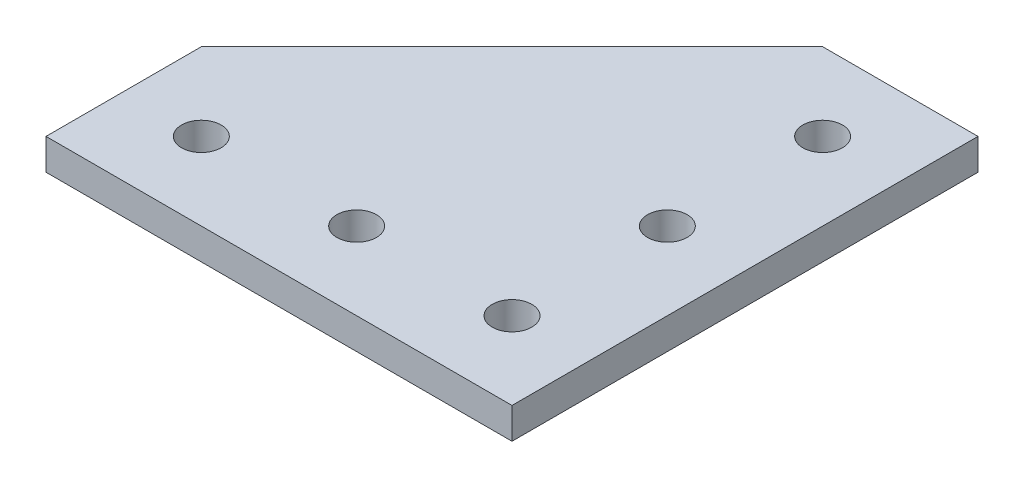
ISO-10303-21;
HEADER;
FILE_DESCRIPTION(('STEP AP214'),'2;1');
FILE_NAME('part.step','',(''),(''),'','','');
FILE_SCHEMA(('AUTOMOTIVE_DESIGN { 1 0 10303 214 1 1 1 1 }'));
ENDSEC;
DATA;
#1=APPLICATION_CONTEXT('core data for automotive mechanical design processes');
#2=APPLICATION_PROTOCOL_DEFINITION('international standard','automotive_design',2000,#1);
#3=PRODUCT_CONTEXT('',#1,'mechanical');
#4=PRODUCT('Part','Part','',(#3));
#5=PRODUCT_RELATED_PRODUCT_CATEGORY('part','',(#4));
#6=PRODUCT_DEFINITION_FORMATION('','',#4);
#7=PRODUCT_DEFINITION_CONTEXT('part definition',#1,'design');
#8=PRODUCT_DEFINITION('design','',#6,#7);
#9=PRODUCT_DEFINITION_SHAPE('','',#8);
#10=(LENGTH_UNIT() NAMED_UNIT(*) SI_UNIT(.MILLI.,.METRE.));
#11=(NAMED_UNIT(*) PLANE_ANGLE_UNIT() SI_UNIT($,.RADIAN.));
#12=(NAMED_UNIT(*) SI_UNIT($,.STERADIAN.) SOLID_ANGLE_UNIT());
#13=UNCERTAINTY_MEASURE_WITH_UNIT(LENGTH_MEASURE(1.E-05),#10,'distance_accuracy_value','');
#14=(GEOMETRIC_REPRESENTATION_CONTEXT(3) GLOBAL_UNCERTAINTY_ASSIGNED_CONTEXT((#13)) GLOBAL_UNIT_ASSIGNED_CONTEXT((#10,
#11,#12)) REPRESENTATION_CONTEXT('',''));
#15=CARTESIAN_POINT('',(0.,0.,0.));
#16=DIRECTION('',(0.,0.,1.));
#17=DIRECTION('',(1.,0.,0.));
#18=AXIS2_PLACEMENT_3D('',#15,#16,#17);
#19=CARTESIAN_POINT('',(0.,4.,0.));
#20=DIRECTION('',(0.,-1.,0.));
#21=DIRECTION('',(0.,0.,-1.));
#22=AXIS2_PLACEMENT_3D('',#19,#20,#21);
#23=PLANE('',#22);
#24=CARTESIAN_POINT('',(0.,4.,-20.));
#25=DIRECTION('',(0.,1.,0.));
#26=DIRECTION('',(0.,0.,1.));
#27=AXIS2_PLACEMENT_3D('',#24,#25,#26);
#28=CIRCLE('',#27,2.55);
#29=CARTESIAN_POINT('',(0.,4.,-17.45));
#30=VERTEX_POINT('',#29);
#31=EDGE_CURVE('E178',#30,#30,#28,.T.);
#32=ORIENTED_EDGE('',*,*,#31,.F.);
#33=EDGE_LOOP('',(#32));
#34=FACE_BOUND('',#33,.T.);
#35=CARTESIAN_POINT('',(-40.,4.,2.79318507107451E-13));
#36=DIRECTION('',(0.,1.,0.));
#37=DIRECTION('',(0.,0.,1.));
#38=AXIS2_PLACEMENT_3D('',#35,#36,#37);
#39=CIRCLE('',#38,2.55);
#40=CARTESIAN_POINT('',(-40.,4.,2.55000000000028));
#41=VERTEX_POINT('',#40);
#42=EDGE_CURVE('E190',#41,#41,#39,.T.);
#43=ORIENTED_EDGE('',*,*,#42,.F.);
#44=EDGE_LOOP('',(#43));
#45=FACE_BOUND('',#44,.T.);
#46=DIRECTION('',(-0.707106781186548,0.,0.707106781186547));
#47=VECTOR('',#46,1.);
#48=CARTESIAN_POINT('',(-50.,4.,-10.));
#49=LINE('',#48,#47);
#50=CARTESIAN_POINT('',(-10.,4.,-50.));
#51=VERTEX_POINT('',#50);
#52=CARTESIAN_POINT('',(-50.,4.,-10.));
#53=VERTEX_POINT('',#52);
#54=EDGE_CURVE('E118',#51,#53,#49,.T.);
#55=ORIENTED_EDGE('',*,*,#54,.T.);
#56=DIRECTION('',(0.,0.,1.));
#57=VECTOR('',#56,1.);
#58=CARTESIAN_POINT('',(-50.,4.,10.));
#59=LINE('',#58,#57);
#60=CARTESIAN_POINT('',(-50.,4.,10.));
#61=VERTEX_POINT('',#60);
#62=EDGE_CURVE('E85',#53,#61,#59,.T.);
#63=ORIENTED_EDGE('',*,*,#62,.T.);
#64=DIRECTION('',(1.,0.,0.));
#65=VECTOR('',#64,1.);
#66=CARTESIAN_POINT('',(10.,4.,9.99999999999999));
#67=LINE('',#66,#65);
#68=CARTESIAN_POINT('',(10.,4.,9.99999999999999));
#69=VERTEX_POINT('',#68);
#70=EDGE_CURVE('E89',#61,#69,#67,.T.);
#71=ORIENTED_EDGE('',*,*,#70,.T.);
#72=DIRECTION('',(0.,0.,-1.));
#73=VECTOR('',#72,1.);
#74=CARTESIAN_POINT('',(10.,4.,9.99999999999999));
#75=LINE('',#74,#73);
#76=CARTESIAN_POINT('',(10.,4.,-50.));
#77=VERTEX_POINT('',#76);
#78=EDGE_CURVE('E93',#69,#77,#75,.T.);
#79=ORIENTED_EDGE('',*,*,#78,.T.);
#80=DIRECTION('',(-1.,0.,0.));
#81=VECTOR('',#80,1.);
#82=CARTESIAN_POINT('',(-10.,4.,-50.));
#83=LINE('',#82,#81);
#84=EDGE_CURVE('E51',#77,#51,#83,.T.);
#85=ORIENTED_EDGE('',*,*,#84,.T.);
#86=EDGE_LOOP('',(#55,#63,#71,#79,#85));
#87=FACE_BOUND('',#86,.T.);
#88=CARTESIAN_POINT('',(-20.,4.,1.39659253553725E-13));
#89=DIRECTION('',(0.,1.,0.));
#90=DIRECTION('',(0.,0.,1.));
#91=AXIS2_PLACEMENT_3D('',#88,#89,#90);
#92=CIRCLE('',#91,2.55);
#93=CARTESIAN_POINT('',(-20.,4.,2.55000000000014));
#94=VERTEX_POINT('',#93);
#95=EDGE_CURVE('E113',#94,#94,#92,.T.);
#96=ORIENTED_EDGE('',*,*,#95,.F.);
#97=EDGE_LOOP('',(#96));
#98=FACE_BOUND('',#97,.T.);
#99=CARTESIAN_POINT('',(0.,4.,0.));
#100=DIRECTION('',(0.,1.,0.));
#101=DIRECTION('',(0.,0.,1.));
#102=AXIS2_PLACEMENT_3D('',#99,#100,#101);
#103=CIRCLE('',#102,2.55);
#104=CARTESIAN_POINT('',(0.,4.,2.55));
#105=VERTEX_POINT('',#104);
#106=EDGE_CURVE('E184',#105,#105,#103,.T.);
#107=ORIENTED_EDGE('',*,*,#106,.F.);
#108=EDGE_LOOP('',(#107));
#109=FACE_BOUND('',#108,.T.);
#110=CARTESIAN_POINT('',(-1.39693134871616E-13,4.,-40.));
#111=DIRECTION('',(0.,1.,0.));
#112=DIRECTION('',(0.,0.,1.));
#113=AXIS2_PLACEMENT_3D('',#110,#111,#112);
#114=CIRCLE('',#113,2.55);
#115=CARTESIAN_POINT('',(-1.39693134871616E-13,4.,-37.45));
#116=VERTEX_POINT('',#115);
#117=EDGE_CURVE('E169',#116,#116,#114,.T.);
#118=ORIENTED_EDGE('',*,*,#117,.F.);
#119=EDGE_LOOP('',(#118));
#120=FACE_BOUND('',#119,.T.);
#121=ADVANCED_FACE('F34',(#34,#45,#87,#98,#109,#120),#23,.F.);
#122=CARTESIAN_POINT('',(0.,0.,0.));
#123=DIRECTION('',(0.,-1.,0.));
#124=DIRECTION('',(0.,0.,-1.));
#125=AXIS2_PLACEMENT_3D('',#122,#123,#124);
#126=PLANE('',#125);
#127=CARTESIAN_POINT('',(0.,0.,-20.));
#128=DIRECTION('',(0.,1.,0.));
#129=DIRECTION('',(0.,0.,1.));
#130=AXIS2_PLACEMENT_3D('',#127,#128,#129);
#131=CIRCLE('',#130,2.55);
#132=CARTESIAN_POINT('',(0.,0.,-17.45));
#133=VERTEX_POINT('',#132);
#134=EDGE_CURVE('E175',#133,#133,#131,.T.);
#135=ORIENTED_EDGE('',*,*,#134,.T.);
#136=EDGE_LOOP('',(#135));
#137=FACE_BOUND('',#136,.T.);
#138=CARTESIAN_POINT('',(-40.,0.,2.79318507107451E-13));
#139=DIRECTION('',(0.,1.,0.));
#140=DIRECTION('',(0.,0.,1.));
#141=AXIS2_PLACEMENT_3D('',#138,#139,#140);
#142=CIRCLE('',#141,2.55);
#143=CARTESIAN_POINT('',(-40.,0.,2.55000000000028));
#144=VERTEX_POINT('',#143);
#145=EDGE_CURVE('E187',#144,#144,#142,.T.);
#146=ORIENTED_EDGE('',*,*,#145,.T.);
#147=EDGE_LOOP('',(#146));
#148=FACE_BOUND('',#147,.T.);
#149=DIRECTION('',(-0.707106781186548,0.,0.707106781186547));
#150=VECTOR('',#149,1.);
#151=CARTESIAN_POINT('',(-50.,0.,-10.));
#152=LINE('',#151,#150);
#153=CARTESIAN_POINT('',(-10.,0.,-50.));
#154=VERTEX_POINT('',#153);
#155=CARTESIAN_POINT('',(-50.,0.,-10.));
#156=VERTEX_POINT('',#155);
#157=EDGE_CURVE('E109',#154,#156,#152,.T.);
#158=ORIENTED_EDGE('',*,*,#157,.F.);
#159=DIRECTION('',(-1.,0.,0.));
#160=VECTOR('',#159,1.);
#161=CARTESIAN_POINT('',(-10.,0.,-50.));
#162=LINE('',#161,#160);
#163=CARTESIAN_POINT('',(10.,0.,-50.));
#164=VERTEX_POINT('',#163);
#165=EDGE_CURVE('E77',#164,#154,#162,.T.);
#166=ORIENTED_EDGE('',*,*,#165,.F.);
#167=DIRECTION('',(0.,0.,-1.));
#168=VECTOR('',#167,1.);
#169=CARTESIAN_POINT('',(10.,0.,9.99999999999999));
#170=LINE('',#169,#168);
#171=CARTESIAN_POINT('',(10.,0.,9.99999999999999));
#172=VERTEX_POINT('',#171);
#173=EDGE_CURVE('E71',#172,#164,#170,.T.);
#174=ORIENTED_EDGE('',*,*,#173,.F.);
#175=DIRECTION('',(1.,0.,0.));
#176=VECTOR('',#175,1.);
#177=CARTESIAN_POINT('',(10.,0.,9.99999999999999));
#178=LINE('',#177,#176);
#179=CARTESIAN_POINT('',(-50.,0.,10.));
#180=VERTEX_POINT('',#179);
#181=EDGE_CURVE('E100',#180,#172,#178,.T.);
#182=ORIENTED_EDGE('',*,*,#181,.F.);
#183=DIRECTION('',(0.,0.,1.));
#184=VECTOR('',#183,1.);
#185=CARTESIAN_POINT('',(-50.,0.,10.));
#186=LINE('',#185,#184);
#187=EDGE_CURVE('E112',#156,#180,#186,.T.);
#188=ORIENTED_EDGE('',*,*,#187,.F.);
#189=EDGE_LOOP('',(#158,#166,#174,#182,#188));
#190=FACE_BOUND('',#189,.T.);
#191=CARTESIAN_POINT('',(-20.,0.,1.39659253553725E-13));
#192=DIRECTION('',(0.,1.,0.));
#193=DIRECTION('',(0.,0.,1.));
#194=AXIS2_PLACEMENT_3D('',#191,#192,#193);
#195=CIRCLE('',#194,2.55);
#196=CARTESIAN_POINT('',(-20.,0.,2.55000000000014));
#197=VERTEX_POINT('',#196);
#198=EDGE_CURVE('E193',#197,#197,#195,.T.);
#199=ORIENTED_EDGE('',*,*,#198,.T.);
#200=EDGE_LOOP('',(#199));
#201=FACE_BOUND('',#200,.T.);
#202=CARTESIAN_POINT('',(0.,0.,0.));
#203=DIRECTION('',(0.,1.,0.));
#204=DIRECTION('',(0.,0.,1.));
#205=AXIS2_PLACEMENT_3D('',#202,#203,#204);
#206=CIRCLE('',#205,2.55);
#207=CARTESIAN_POINT('',(0.,0.,2.55));
#208=VERTEX_POINT('',#207);
#209=EDGE_CURVE('E181',#208,#208,#206,.T.);
#210=ORIENTED_EDGE('',*,*,#209,.T.);
#211=EDGE_LOOP('',(#210));
#212=FACE_BOUND('',#211,.T.);
#213=CARTESIAN_POINT('',(-1.39693134871616E-13,0.,-40.));
#214=DIRECTION('',(0.,1.,0.));
#215=DIRECTION('',(0.,0.,1.));
#216=AXIS2_PLACEMENT_3D('',#213,#214,#215);
#217=CIRCLE('',#216,2.55);
#218=CARTESIAN_POINT('',(-1.39693134871616E-13,0.,-37.45));
#219=VERTEX_POINT('',#218);
#220=EDGE_CURVE('E172',#219,#219,#217,.T.);
#221=ORIENTED_EDGE('',*,*,#220,.T.);
#222=EDGE_LOOP('',(#221));
#223=FACE_BOUND('',#222,.T.);
#224=ADVANCED_FACE('F122',(#137,#148,#190,#201,#212,#223),#126,.T.);
#225=CARTESIAN_POINT('',(-50.,4.,-10.));
#226=DIRECTION('',(0.707106781186547,0.,0.707106781186548));
#227=DIRECTION('',(0.707106781186548,0.,-0.707106781186547));
#228=AXIS2_PLACEMENT_3D('',#225,#226,#227);
#229=PLANE('',#228);
#230=ORIENTED_EDGE('',*,*,#157,.T.);
#231=DIRECTION('',(0.,-1.,0.));
#232=VECTOR('',#231,1.);
#233=CARTESIAN_POINT('',(-50.,4.,-10.));
#234=LINE('',#233,#232);
#235=EDGE_CURVE('E11',#53,#156,#234,.T.);
#236=ORIENTED_EDGE('',*,*,#235,.F.);
#237=ORIENTED_EDGE('',*,*,#54,.F.);
#238=DIRECTION('',(0.,-1.,0.));
#239=VECTOR('',#238,1.);
#240=CARTESIAN_POINT('',(-10.,4.,-50.));
#241=LINE('',#240,#239);
#242=EDGE_CURVE('E105',#51,#154,#241,.T.);
#243=ORIENTED_EDGE('',*,*,#242,.T.);
#244=EDGE_LOOP('',(#230,#236,#237,#243));
#245=FACE_BOUND('',#244,.T.);
#246=ADVANCED_FACE('F36',(#245),#229,.F.);
#247=CARTESIAN_POINT('',(-50.,4.,10.));
#248=DIRECTION('',(1.,0.,0.));
#249=DIRECTION('',(0.,0.,-1.));
#250=AXIS2_PLACEMENT_3D('',#247,#248,#249);
#251=PLANE('',#250);
#252=ORIENTED_EDGE('',*,*,#187,.T.);
#253=DIRECTION('',(0.,-1.,0.));
#254=VECTOR('',#253,1.);
#255=CARTESIAN_POINT('',(-50.,4.,10.));
#256=LINE('',#255,#254);
#257=EDGE_CURVE('E43',#61,#180,#256,.T.);
#258=ORIENTED_EDGE('',*,*,#257,.F.);
#259=ORIENTED_EDGE('',*,*,#62,.F.);
#260=ORIENTED_EDGE('',*,*,#235,.T.);
#261=EDGE_LOOP('',(#252,#258,#259,#260));
#262=FACE_BOUND('',#261,.T.);
#263=ADVANCED_FACE('F250',(#262),#251,.F.);
#264=CARTESIAN_POINT('',(10.,4.,9.99999999999999));
#265=DIRECTION('',(0.,0.,-1.));
#266=DIRECTION('',(-1.,0.,0.));
#267=AXIS2_PLACEMENT_3D('',#264,#265,#266);
#268=PLANE('',#267);
#269=ORIENTED_EDGE('',*,*,#181,.T.);
#270=DIRECTION('',(0.,-1.,0.));
#271=VECTOR('',#270,1.);
#272=CARTESIAN_POINT('',(10.,4.,9.99999999999999));
#273=LINE('',#272,#271);
#274=EDGE_CURVE('E97',#69,#172,#273,.T.);
#275=ORIENTED_EDGE('',*,*,#274,.F.);
#276=ORIENTED_EDGE('',*,*,#70,.F.);
#277=ORIENTED_EDGE('',*,*,#257,.T.);
#278=EDGE_LOOP('',(#269,#275,#276,#277));
#279=FACE_BOUND('',#278,.T.);
#280=ADVANCED_FACE('F98',(#279),#268,.F.);
#281=CARTESIAN_POINT('',(10.,4.,9.99999999999999));
#282=DIRECTION('',(-1.,0.,0.));
#283=DIRECTION('',(0.,0.,1.));
#284=AXIS2_PLACEMENT_3D('',#281,#282,#283);
#285=PLANE('',#284);
#286=ORIENTED_EDGE('',*,*,#173,.T.);
#287=DIRECTION('',(0.,-1.,0.));
#288=VECTOR('',#287,1.);
#289=CARTESIAN_POINT('',(10.,4.,-50.));
#290=LINE('',#289,#288);
#291=EDGE_CURVE('E101',#77,#164,#290,.T.);
#292=ORIENTED_EDGE('',*,*,#291,.F.);
#293=ORIENTED_EDGE('',*,*,#78,.F.);
#294=ORIENTED_EDGE('',*,*,#274,.T.);
#295=EDGE_LOOP('',(#286,#292,#293,#294));
#296=FACE_BOUND('',#295,.T.);
#297=ADVANCED_FACE('F103',(#296),#285,.F.);
#298=CARTESIAN_POINT('',(-10.,4.,-50.));
#299=DIRECTION('',(0.,0.,1.));
#300=DIRECTION('',(1.,0.,0.));
#301=AXIS2_PLACEMENT_3D('',#298,#299,#300);
#302=PLANE('',#301);
#303=ORIENTED_EDGE('',*,*,#165,.T.);
#304=ORIENTED_EDGE('',*,*,#242,.F.);
#305=ORIENTED_EDGE('',*,*,#84,.F.);
#306=ORIENTED_EDGE('',*,*,#291,.T.);
#307=EDGE_LOOP('',(#303,#304,#305,#306));
#308=FACE_BOUND('',#307,.T.);
#309=ADVANCED_FACE('F127',(#308),#302,.F.);
#310=CARTESIAN_POINT('',(-20.,4.,1.39659253553725E-13));
#311=DIRECTION('',(0.,-1.,0.));
#312=DIRECTION('',(0.,0.,-1.));
#313=AXIS2_PLACEMENT_3D('',#310,#311,#312);
#314=CYLINDRICAL_SURFACE('',#313,2.55);
#315=ORIENTED_EDGE('',*,*,#95,.T.);
#316=EDGE_LOOP('',(#315));
#317=FACE_BOUND('',#316,.T.);
#318=ORIENTED_EDGE('',*,*,#198,.F.);
#319=EDGE_LOOP('',(#318));
#320=FACE_BOUND('',#319,.T.);
#321=ADVANCED_FACE('F129',(#317,#320),#314,.F.);
#322=CARTESIAN_POINT('',(-40.,4.,2.79318507107451E-13));
#323=DIRECTION('',(0.,-1.,0.));
#324=DIRECTION('',(0.,0.,-1.));
#325=AXIS2_PLACEMENT_3D('',#322,#323,#324);
#326=CYLINDRICAL_SURFACE('',#325,2.55);
#327=ORIENTED_EDGE('',*,*,#42,.T.);
#328=EDGE_LOOP('',(#327));
#329=FACE_BOUND('',#328,.T.);
#330=ORIENTED_EDGE('',*,*,#145,.F.);
#331=EDGE_LOOP('',(#330));
#332=FACE_BOUND('',#331,.T.);
#333=ADVANCED_FACE('F135',(#329,#332),#326,.F.);
#334=CARTESIAN_POINT('',(0.,4.,0.));
#335=DIRECTION('',(0.,-1.,0.));
#336=DIRECTION('',(0.,0.,-1.));
#337=AXIS2_PLACEMENT_3D('',#334,#335,#336);
#338=CYLINDRICAL_SURFACE('',#337,2.55);
#339=ORIENTED_EDGE('',*,*,#106,.T.);
#340=EDGE_LOOP('',(#339));
#341=FACE_BOUND('',#340,.T.);
#342=ORIENTED_EDGE('',*,*,#209,.F.);
#343=EDGE_LOOP('',(#342));
#344=FACE_BOUND('',#343,.T.);
#345=ADVANCED_FACE('F152',(#341,#344),#338,.F.);
#346=CARTESIAN_POINT('',(0.,4.,-20.));
#347=DIRECTION('',(0.,-1.,0.));
#348=DIRECTION('',(0.,0.,-1.));
#349=AXIS2_PLACEMENT_3D('',#346,#347,#348);
#350=CYLINDRICAL_SURFACE('',#349,2.55);
#351=ORIENTED_EDGE('',*,*,#31,.T.);
#352=EDGE_LOOP('',(#351));
#353=FACE_BOUND('',#352,.T.);
#354=ORIENTED_EDGE('',*,*,#134,.F.);
#355=EDGE_LOOP('',(#354));
#356=FACE_BOUND('',#355,.T.);
#357=ADVANCED_FACE('F156',(#353,#356),#350,.F.);
#358=CARTESIAN_POINT('',(-1.39693134871616E-13,4.,-40.));
#359=DIRECTION('',(0.,-1.,0.));
#360=DIRECTION('',(0.,0.,-1.));
#361=AXIS2_PLACEMENT_3D('',#358,#359,#360);
#362=CYLINDRICAL_SURFACE('',#361,2.55);
#363=ORIENTED_EDGE('',*,*,#117,.T.);
#364=EDGE_LOOP('',(#363));
#365=FACE_BOUND('',#364,.T.);
#366=ORIENTED_EDGE('',*,*,#220,.F.);
#367=EDGE_LOOP('',(#366));
#368=FACE_BOUND('',#367,.T.);
#369=ADVANCED_FACE('F160',(#365,#368),#362,.F.);
#370=CLOSED_SHELL('',(#121,#224,#246,#263,#280,#297,#309,#321,#333,#345,#357,#369));
#371=MANIFOLD_SOLID_BREP('B2',#370);
#372=ADVANCED_BREP_SHAPE_REPRESENTATION('',(#18,#371),#14);
#373=SHAPE_DEFINITION_REPRESENTATION(#9,#372);
ENDSEC;
END-ISO-10303-21;
